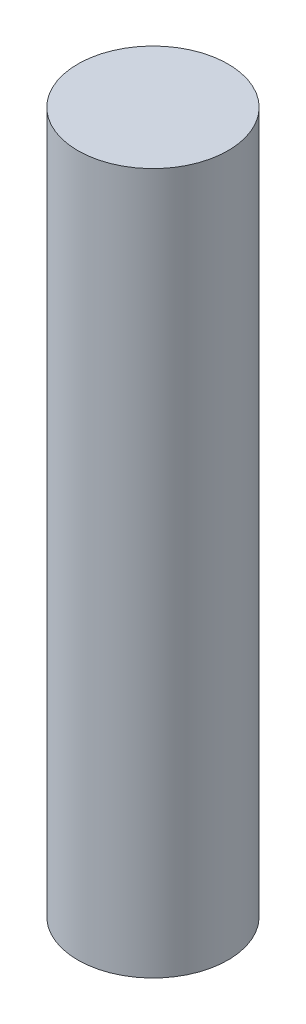
ISO-10303-21;
HEADER;
FILE_DESCRIPTION(('STEP AP214'),'2;1');
FILE_NAME('part.step','',(''),(''),'','','');
FILE_SCHEMA(('AUTOMOTIVE_DESIGN { 1 0 10303 214 1 1 1 1 }'));
ENDSEC;
DATA;
#1=APPLICATION_CONTEXT('core data for automotive mechanical design processes');
#2=APPLICATION_PROTOCOL_DEFINITION('international standard','automotive_design',2000,#1);
#3=PRODUCT_CONTEXT('',#1,'mechanical');
#4=PRODUCT('Part','Part','',(#3));
#5=PRODUCT_RELATED_PRODUCT_CATEGORY('part','',(#4));
#6=PRODUCT_DEFINITION_FORMATION('','',#4);
#7=PRODUCT_DEFINITION_CONTEXT('part definition',#1,'design');
#8=PRODUCT_DEFINITION('design','',#6,#7);
#9=PRODUCT_DEFINITION_SHAPE('','',#8);
#10=(LENGTH_UNIT() NAMED_UNIT(*) SI_UNIT(.MILLI.,.METRE.));
#11=(NAMED_UNIT(*) PLANE_ANGLE_UNIT() SI_UNIT($,.RADIAN.));
#12=(NAMED_UNIT(*) SI_UNIT($,.STERADIAN.) SOLID_ANGLE_UNIT());
#13=UNCERTAINTY_MEASURE_WITH_UNIT(LENGTH_MEASURE(1.E-05),#10,'distance_accuracy_value','');
#14=(GEOMETRIC_REPRESENTATION_CONTEXT(3) GLOBAL_UNCERTAINTY_ASSIGNED_CONTEXT((#13)) GLOBAL_UNIT_ASSIGNED_CONTEXT((#10,
#11,#12)) REPRESENTATION_CONTEXT('',''));
#15=CARTESIAN_POINT('',(0.,0.,0.));
#16=DIRECTION('',(0.,0.,1.));
#17=DIRECTION('',(1.,0.,0.));
#18=AXIS2_PLACEMENT_3D('',#15,#16,#17);
#19=CARTESIAN_POINT('',(0.,14.,0.));
#20=DIRECTION('',(0.,-1.,0.));
#21=DIRECTION('',(0.,0.,-1.));
#22=AXIS2_PLACEMENT_3D('',#19,#20,#21);
#23=CYLINDRICAL_SURFACE('',#22,1.5);
#24=CARTESIAN_POINT('',(0.,14.,0.));
#25=DIRECTION('',(0.,1.,0.));
#26=DIRECTION('',(0.,0.,1.));
#27=AXIS2_PLACEMENT_3D('',#24,#25,#26);
#28=CIRCLE('',#27,1.5);
#29=CARTESIAN_POINT('',(0.,14.,1.5));
#30=VERTEX_POINT('',#29);
#31=EDGE_CURVE('E10',#30,#30,#28,.T.);
#32=ORIENTED_EDGE('',*,*,#31,.F.);
#33=EDGE_LOOP('',(#32));
#34=FACE_BOUND('',#33,.T.);
#35=CARTESIAN_POINT('',(0.,0.,0.));
#36=DIRECTION('',(0.,1.,0.));
#37=DIRECTION('',(0.,0.,1.));
#38=AXIS2_PLACEMENT_3D('',#35,#36,#37);
#39=CIRCLE('',#38,1.5);
#40=CARTESIAN_POINT('',(0.,0.,1.5));
#41=VERTEX_POINT('',#40);
#42=EDGE_CURVE('E35',#41,#41,#39,.T.);
#43=ORIENTED_EDGE('',*,*,#42,.T.);
#44=EDGE_LOOP('',(#43));
#45=FACE_BOUND('',#44,.T.);
#46=ADVANCED_FACE('F32',(#34,#45),#23,.T.);
#47=CARTESIAN_POINT('',(0.,14.,0.));
#48=DIRECTION('',(0.,1.,0.));
#49=DIRECTION('',(0.,0.,1.));
#50=AXIS2_PLACEMENT_3D('',#47,#48,#49);
#51=PLANE('',#50);
#52=ORIENTED_EDGE('',*,*,#31,.T.);
#53=EDGE_LOOP('',(#52));
#54=FACE_BOUND('',#53,.T.);
#55=ADVANCED_FACE('F47',(#54),#51,.T.);
#56=CARTESIAN_POINT('',(0.,0.,0.));
#57=DIRECTION('',(0.,1.,0.));
#58=DIRECTION('',(0.,0.,1.));
#59=AXIS2_PLACEMENT_3D('',#56,#57,#58);
#60=PLANE('',#59);
#61=ORIENTED_EDGE('',*,*,#42,.F.);
#62=EDGE_LOOP('',(#61));
#63=FACE_BOUND('',#62,.T.);
#64=ADVANCED_FACE('F45',(#63),#60,.F.);
#65=CLOSED_SHELL('',(#46,#55,#64));
#66=MANIFOLD_SOLID_BREP('B2',#65);
#67=ADVANCED_BREP_SHAPE_REPRESENTATION('',(#18,#66),#14);
#68=SHAPE_DEFINITION_REPRESENTATION(#9,#67);
ENDSEC;
END-ISO-10303-21;
